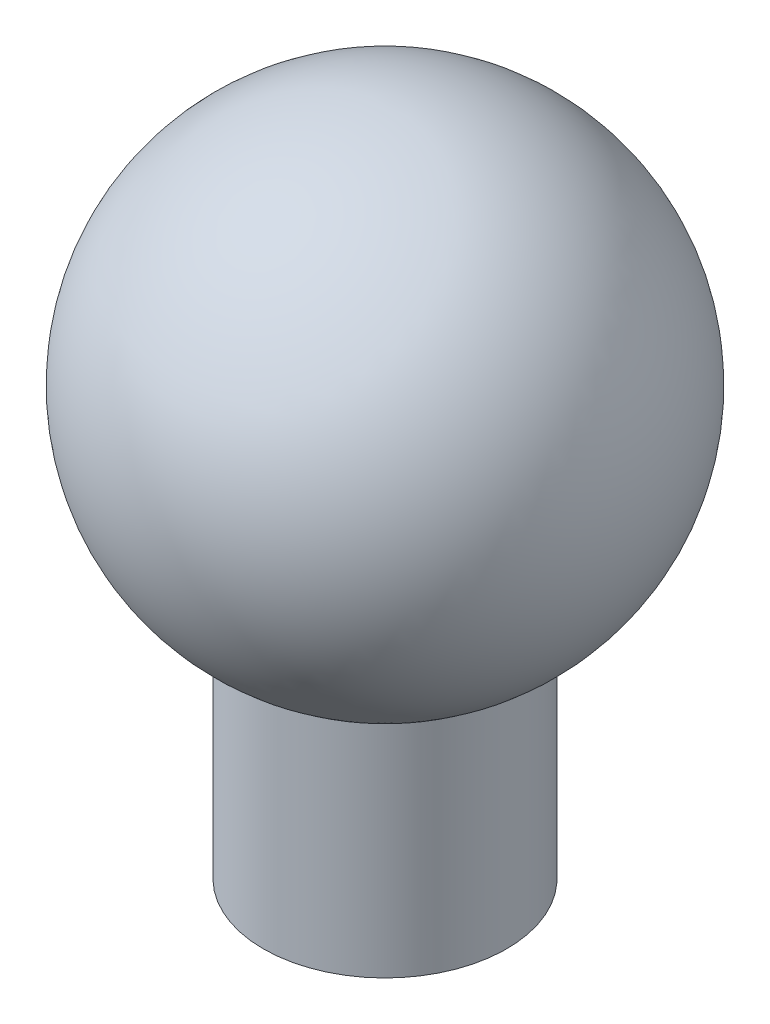
ISO-10303-21;
HEADER;
FILE_DESCRIPTION(('STEP AP214'),'2;1');
FILE_NAME('part.step','',(''),(''),'','','');
FILE_SCHEMA(('AUTOMOTIVE_DESIGN { 1 0 10303 214 1 1 1 1 }'));
ENDSEC;
DATA;
#1=APPLICATION_CONTEXT('core data for automotive mechanical design processes');
#2=APPLICATION_PROTOCOL_DEFINITION('international standard','automotive_design',2000,#1);
#3=PRODUCT_CONTEXT('',#1,'mechanical');
#4=PRODUCT('Part','Part','',(#3));
#5=PRODUCT_RELATED_PRODUCT_CATEGORY('part','',(#4));
#6=PRODUCT_DEFINITION_FORMATION('','',#4);
#7=PRODUCT_DEFINITION_CONTEXT('part definition',#1,'design');
#8=PRODUCT_DEFINITION('design','',#6,#7);
#9=PRODUCT_DEFINITION_SHAPE('','',#8);
#10=(LENGTH_UNIT() NAMED_UNIT(*) SI_UNIT(.MILLI.,.METRE.));
#11=(NAMED_UNIT(*) PLANE_ANGLE_UNIT() SI_UNIT($,.RADIAN.));
#12=(NAMED_UNIT(*) SI_UNIT($,.STERADIAN.) SOLID_ANGLE_UNIT());
#13=UNCERTAINTY_MEASURE_WITH_UNIT(LENGTH_MEASURE(1.E-05),#10,'distance_accuracy_value','');
#14=(GEOMETRIC_REPRESENTATION_CONTEXT(3) GLOBAL_UNCERTAINTY_ASSIGNED_CONTEXT((#13)) GLOBAL_UNIT_ASSIGNED_CONTEXT((#10,
#11,#12)) REPRESENTATION_CONTEXT('',''));
#15=CARTESIAN_POINT('',(0.,0.,0.));
#16=DIRECTION('',(0.,0.,1.));
#17=DIRECTION('',(1.,0.,0.));
#18=AXIS2_PLACEMENT_3D('',#15,#16,#17);
#19=CARTESIAN_POINT('',(0.,-17.5277188658502,0.));
#20=DIRECTION('',(0.,-1.,0.));
#21=DIRECTION('',(0.,0.,-1.));
#22=AXIS2_PLACEMENT_3D('',#19,#20,#21);
#23=CYLINDRICAL_SURFACE('',#22,23.26005);
#24=CARTESIAN_POINT('',(0.,-17.5277188658502,0.));
#25=DIRECTION('',(0.,1.,0.));
#26=DIRECTION('',(0.,0.,1.));
#27=AXIS2_PLACEMENT_3D('',#24,#25,#26);
#28=CIRCLE('',#27,23.26005);
#29=CARTESIAN_POINT('',(0.,-17.5277188658502,23.26005));
#30=VERTEX_POINT('',#29);
#31=EDGE_CURVE('E10',#30,#30,#28,.T.);
#32=ORIENTED_EDGE('',*,*,#31,.F.);
#33=EDGE_LOOP('',(#32));
#34=FACE_BOUND('',#33,.T.);
#35=CARTESIAN_POINT('',(0.,-59.8187188658502,0.));
#36=DIRECTION('',(0.,1.,0.));
#37=DIRECTION('',(0.,0.,1.));
#38=AXIS2_PLACEMENT_3D('',#35,#36,#37);
#39=CIRCLE('',#38,23.26005);
#40=CARTESIAN_POINT('',(0.,-59.8187188658502,23.26005));
#41=VERTEX_POINT('',#40);
#42=EDGE_CURVE('E37',#41,#41,#39,.T.);
#43=ORIENTED_EDGE('',*,*,#42,.T.);
#44=EDGE_LOOP('',(#43));
#45=FACE_BOUND('',#44,.T.);
#46=ADVANCED_FACE('F34',(#34,#45),#23,.T.);
#47=CARTESIAN_POINT('',(0.,-59.8187188658502,0.));
#48=DIRECTION('',(0.,1.,0.));
#49=DIRECTION('',(0.,0.,1.));
#50=AXIS2_PLACEMENT_3D('',#47,#48,#49);
#51=PLANE('',#50);
#52=ORIENTED_EDGE('',*,*,#42,.F.);
#53=EDGE_LOOP('',(#52));
#54=FACE_BOUND('',#53,.T.);
#55=ADVANCED_FACE('F47',(#54),#51,.F.);
#56=CARTESIAN_POINT('',(0.,21.9438811341498,0.));
#57=DIRECTION('',(0.,-1.,0.));
#58=DIRECTION('',(-1.,0.,0.));
#59=AXIS2_PLACEMENT_3D('',#56,#57,#58);
#60=SPHERICAL_SURFACE('',#59,45.81525);
#61=ORIENTED_EDGE('',*,*,#31,.T.);
#62=EDGE_LOOP('',(#61));
#63=FACE_BOUND('',#62,.T.);
#64=ADVANCED_FACE('F49',(#63),#60,.T.);
#65=CLOSED_SHELL('',(#46,#55,#64));
#66=MANIFOLD_SOLID_BREP('B2',#65);
#67=ADVANCED_BREP_SHAPE_REPRESENTATION('',(#18,#66),#14);
#68=SHAPE_DEFINITION_REPRESENTATION(#9,#67);
ENDSEC;
END-ISO-10303-21;
